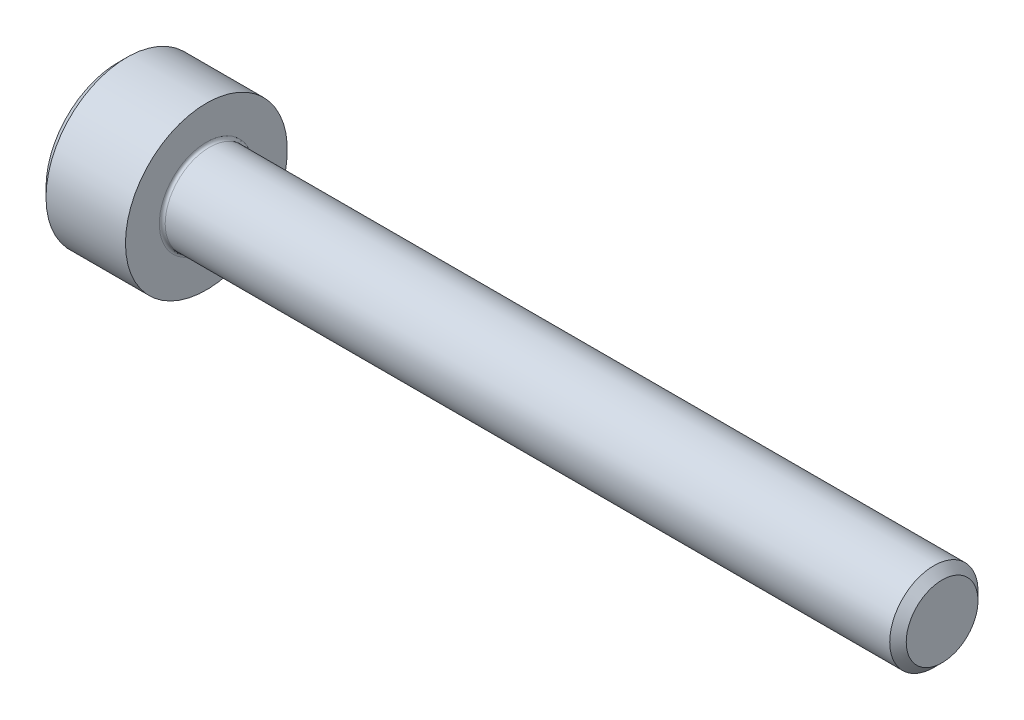
ISO-10303-21;
HEADER;
FILE_DESCRIPTION(('STEP AP214'),'2;1');
FILE_NAME('part.step','',(''),(''),'','','');
FILE_SCHEMA(('AUTOMOTIVE_DESIGN { 1 0 10303 214 1 1 1 1 }'));
ENDSEC;
DATA;
#1=APPLICATION_CONTEXT('core data for automotive mechanical design processes');
#2=APPLICATION_PROTOCOL_DEFINITION('international standard','automotive_design',2000,#1);
#3=PRODUCT_CONTEXT('',#1,'mechanical');
#4=PRODUCT('Part','Part','',(#3));
#5=PRODUCT_RELATED_PRODUCT_CATEGORY('part','',(#4));
#6=PRODUCT_DEFINITION_FORMATION('','',#4);
#7=PRODUCT_DEFINITION_CONTEXT('part definition',#1,'design');
#8=PRODUCT_DEFINITION('design','',#6,#7);
#9=PRODUCT_DEFINITION_SHAPE('','',#8);
#10=(LENGTH_UNIT() NAMED_UNIT(*) SI_UNIT(.MILLI.,.METRE.));
#11=(NAMED_UNIT(*) PLANE_ANGLE_UNIT() SI_UNIT($,.RADIAN.));
#12=(NAMED_UNIT(*) SI_UNIT($,.STERADIAN.) SOLID_ANGLE_UNIT());
#13=UNCERTAINTY_MEASURE_WITH_UNIT(LENGTH_MEASURE(1.E-05),#10,'distance_accuracy_value','');
#14=(GEOMETRIC_REPRESENTATION_CONTEXT(3) GLOBAL_UNCERTAINTY_ASSIGNED_CONTEXT((#13)) GLOBAL_UNIT_ASSIGNED_CONTEXT((#10,
#11,#12)) REPRESENTATION_CONTEXT('',''));
#15=CARTESIAN_POINT('',(0.,0.,0.));
#16=DIRECTION('',(0.,0.,1.));
#17=DIRECTION('',(1.,0.,0.));
#18=AXIS2_PLACEMENT_3D('',#15,#16,#17);
#19=CARTESIAN_POINT('',(0.,0.,0.));
#20=DIRECTION('',(-1.,0.,0.));
#21=DIRECTION('',(0.,0.,1.));
#22=AXIS2_PLACEMENT_3D('',#19,#20,#21);
#23=PLANE('',#22);
#24=DIRECTION('',(0.,-0.5,0.866025403784438));
#25=VECTOR('',#24,1.);
#26=CARTESIAN_POINT('',(0.,1.47801668912544,0.));
#27=LINE('',#26,#25);
#28=CARTESIAN_POINT('',(0.,1.47801668912544,0.));
#29=VERTEX_POINT('',#28);
#30=CARTESIAN_POINT('',(0.,0.739008344562717,1.28));
#31=VERTEX_POINT('',#30);
#32=EDGE_CURVE('E386',#29,#31,#27,.T.);
#33=ORIENTED_EDGE('',*,*,#32,.T.);
#34=DIRECTION('',(0.,1.,0.));
#35=VECTOR('',#34,1.);
#36=CARTESIAN_POINT('',(0.,-0.739008344562726,1.28));
#37=LINE('',#36,#35);
#38=CARTESIAN_POINT('',(0.,-0.739008344562726,1.28));
#39=VERTEX_POINT('',#38);
#40=EDGE_CURVE('E130',#39,#31,#37,.T.);
#41=ORIENTED_EDGE('',*,*,#40,.F.);
#42=DIRECTION('',(0.,-0.500000000000001,-0.866025403784438));
#43=VECTOR('',#42,1.);
#44=CARTESIAN_POINT('',(0.,-0.739008344562726,1.28));
#45=LINE('',#44,#43);
#46=CARTESIAN_POINT('',(0.,-1.47801668912545,0.));
#47=VERTEX_POINT('',#46);
#48=EDGE_CURVE('E389',#39,#47,#45,.T.);
#49=ORIENTED_EDGE('',*,*,#48,.T.);
#50=DIRECTION('',(0.,0.5,-0.866025403784439));
#51=VECTOR('',#50,1.);
#52=CARTESIAN_POINT('',(0.,-1.47801668912545,0.));
#53=LINE('',#52,#51);
#54=CARTESIAN_POINT('',(0.,-0.739008344562727,-1.28));
#55=VERTEX_POINT('',#54);
#56=EDGE_CURVE('E392',#47,#55,#53,.T.);
#57=ORIENTED_EDGE('',*,*,#56,.T.);
#58=DIRECTION('',(0.,-1.,0.));
#59=VECTOR('',#58,1.);
#60=CARTESIAN_POINT('',(0.,0.739008344562715,-1.28));
#61=LINE('',#60,#59);
#62=CARTESIAN_POINT('',(0.,0.739008344562715,-1.28));
#63=VERTEX_POINT('',#62);
#64=EDGE_CURVE('E395',#63,#55,#61,.T.);
#65=ORIENTED_EDGE('',*,*,#64,.F.);
#66=DIRECTION('',(0.,-0.500000000000001,-0.866025403784438));
#67=VECTOR('',#66,1.);
#68=CARTESIAN_POINT('',(0.,1.47801668912544,0.));
#69=LINE('',#68,#67);
#70=EDGE_CURVE('E125',#29,#63,#69,.T.);
#71=ORIENTED_EDGE('',*,*,#70,.F.);
#72=EDGE_LOOP('',(#33,#41,#49,#57,#65,#71));
#73=FACE_BOUND('',#72,.T.);
#74=CARTESIAN_POINT('',(0.,0.,0.));
#75=DIRECTION('',(-1.,0.,0.));
#76=DIRECTION('',(0.,0.,1.));
#77=AXIS2_PLACEMENT_3D('',#74,#75,#76);
#78=CIRCLE('',#77,2.45);
#79=CARTESIAN_POINT('',(0.,0.,2.45));
#80=VERTEX_POINT('',#79);
#81=EDGE_CURVE('E141',#80,#80,#78,.T.);
#82=ORIENTED_EDGE('',*,*,#81,.T.);
#83=EDGE_LOOP('',(#82));
#84=FACE_BOUND('',#83,.T.);
#85=ADVANCED_FACE('F34',(#73,#84),#23,.T.);
#86=CARTESIAN_POINT('',(28.,1.2195,0.));
#87=DIRECTION('',(1.,0.,0.));
#88=DIRECTION('',(0.,0.,-1.));
#89=AXIS2_PLACEMENT_3D('',#86,#87,#88);
#90=PLANE('',#89);
#91=CARTESIAN_POINT('',(28.,0.,0.));
#92=DIRECTION('',(-1.,0.,0.));
#93=DIRECTION('',(0.,0.,1.));
#94=AXIS2_PLACEMENT_3D('',#91,#92,#93);
#95=CIRCLE('',#94,1.2195);
#96=CARTESIAN_POINT('',(28.,0.,1.2195));
#97=VERTEX_POINT('',#96);
#98=EDGE_CURVE('E154',#97,#97,#95,.T.);
#99=ORIENTED_EDGE('',*,*,#98,.F.);
#100=EDGE_LOOP('',(#99));
#101=FACE_BOUND('',#100,.T.);
#102=ADVANCED_FACE('F175',(#101),#90,.T.);
#103=CARTESIAN_POINT('',(28.,0.,0.));
#104=DIRECTION('',(-1.,0.,0.));
#105=DIRECTION('',(0.,0.,1.));
#106=AXIS2_PLACEMENT_3D('',#103,#104,#105);
#107=CONICAL_SURFACE('',#106,1.2195,0.785398163397403);
#108=CARTESIAN_POINT('',(27.7195,0.,0.));
#109=DIRECTION('',(-1.,0.,0.));
#110=DIRECTION('',(0.,0.,1.));
#111=AXIS2_PLACEMENT_3D('',#108,#109,#110);
#112=CIRCLE('',#111,1.49999999999998);
#113=CARTESIAN_POINT('',(27.7195,0.,1.49999999999998));
#114=VERTEX_POINT('',#113);
#115=EDGE_CURVE('E151',#114,#114,#112,.T.);
#116=ORIENTED_EDGE('',*,*,#115,.F.);
#117=EDGE_LOOP('',(#116));
#118=FACE_BOUND('',#117,.T.);
#119=ORIENTED_EDGE('',*,*,#98,.T.);
#120=EDGE_LOOP('',(#119));
#121=FACE_BOUND('',#120,.T.);
#122=ADVANCED_FACE('F181',(#118,#121),#107,.T.);
#123=CARTESIAN_POINT('',(-31.75,0.,0.));
#124=DIRECTION('',(-1.,0.,0.));
#125=DIRECTION('',(0.,0.,1.));
#126=AXIS2_PLACEMENT_3D('',#123,#124,#125);
#127=CYLINDRICAL_SURFACE('',#126,1.49999999999999);
#128=CARTESIAN_POINT('',(3.1,0.,0.));
#129=DIRECTION('',(1.,0.,0.));
#130=DIRECTION('',(0.,0.,-1.));
#131=AXIS2_PLACEMENT_3D('',#128,#129,#130);
#132=CIRCLE('',#131,1.49999999999999);
#133=CARTESIAN_POINT('',(3.1,0.,-1.49999999999999));
#134=VERTEX_POINT('',#133);
#135=EDGE_CURVE('E11',#134,#134,#132,.T.);
#136=ORIENTED_EDGE('',*,*,#135,.T.);
#137=EDGE_LOOP('',(#136));
#138=FACE_BOUND('',#137,.T.);
#139=ORIENTED_EDGE('',*,*,#115,.T.);
#140=EDGE_LOOP('',(#139));
#141=FACE_BOUND('',#140,.T.);
#142=ADVANCED_FACE('F192',(#138,#141),#127,.T.);
#143=CARTESIAN_POINT('',(3.,2.75,0.));
#144=DIRECTION('',(1.,0.,0.));
#145=DIRECTION('',(0.,0.,-1.));
#146=AXIS2_PLACEMENT_3D('',#143,#144,#145);
#147=PLANE('',#146);
#148=CARTESIAN_POINT('',(3.,0.,0.));
#149=DIRECTION('',(1.,0.,0.));
#150=DIRECTION('',(0.,0.,-1.));
#151=AXIS2_PLACEMENT_3D('',#148,#149,#150);
#152=CIRCLE('',#151,1.59999999999999);
#153=CARTESIAN_POINT('',(3.,0.,-1.59999999999999));
#154=VERTEX_POINT('',#153);
#155=EDGE_CURVE('E42',#154,#154,#152,.F.);
#156=ORIENTED_EDGE('',*,*,#155,.T.);
#157=EDGE_LOOP('',(#156));
#158=FACE_BOUND('',#157,.T.);
#159=CARTESIAN_POINT('',(3.,0.,0.));
#160=DIRECTION('',(-1.,0.,0.));
#161=DIRECTION('',(0.,0.,1.));
#162=AXIS2_PLACEMENT_3D('',#159,#160,#161);
#163=CIRCLE('',#162,2.75);
#164=CARTESIAN_POINT('',(3.,0.,2.75));
#165=VERTEX_POINT('',#164);
#166=EDGE_CURVE('E148',#165,#165,#163,.T.);
#167=ORIENTED_EDGE('',*,*,#166,.F.);
#168=EDGE_LOOP('',(#167));
#169=FACE_BOUND('',#168,.T.);
#170=ADVANCED_FACE('F159',(#158,#169),#147,.T.);
#171=CARTESIAN_POINT('',(-31.75,0.,0.));
#172=DIRECTION('',(-1.,0.,0.));
#173=DIRECTION('',(0.,0.,1.));
#174=AXIS2_PLACEMENT_3D('',#171,#172,#173);
#175=CYLINDRICAL_SURFACE('',#174,2.75);
#176=ORIENTED_EDGE('',*,*,#166,.T.);
#177=EDGE_LOOP('',(#176));
#178=FACE_BOUND('',#177,.T.);
#179=CARTESIAN_POINT('',(0.300000000000002,0.,0.));
#180=DIRECTION('',(-1.,0.,0.));
#181=DIRECTION('',(0.,0.,1.));
#182=AXIS2_PLACEMENT_3D('',#179,#180,#181);
#183=CIRCLE('',#182,2.75);
#184=CARTESIAN_POINT('',(0.300000000000002,0.,2.75));
#185=VERTEX_POINT('',#184);
#186=EDGE_CURVE('E145',#185,#185,#183,.T.);
#187=ORIENTED_EDGE('',*,*,#186,.F.);
#188=EDGE_LOOP('',(#187));
#189=FACE_BOUND('',#188,.T.);
#190=ADVANCED_FACE('F170',(#178,#189),#175,.T.);
#191=CARTESIAN_POINT('',(0.,0.,0.));
#192=DIRECTION('',(1.,0.,0.));
#193=DIRECTION('',(0.,0.,-1.));
#194=AXIS2_PLACEMENT_3D('',#191,#192,#193);
#195=CONICAL_SURFACE('',#194,2.45,0.785398163397441);
#196=ORIENTED_EDGE('',*,*,#186,.T.);
#197=EDGE_LOOP('',(#196));
#198=FACE_BOUND('',#197,.T.);
#199=ORIENTED_EDGE('',*,*,#81,.F.);
#200=EDGE_LOOP('',(#199));
#201=FACE_BOUND('',#200,.T.);
#202=ADVANCED_FACE('F163',(#198,#201),#195,.T.);
#203=CARTESIAN_POINT('',(3.1,0.,0.));
#204=DIRECTION('',(1.,0.,0.));
#205=DIRECTION('',(0.,0.,-1.));
#206=AXIS2_PLACEMENT_3D('',#203,#204,#205);
#207=TOROIDAL_SURFACE('',#206,1.59999999999999,0.1);
#208=ORIENTED_EDGE('',*,*,#135,.F.);
#209=EDGE_LOOP('',(#208));
#210=FACE_BOUND('',#209,.T.);
#211=ORIENTED_EDGE('',*,*,#155,.F.);
#212=EDGE_LOOP('',(#211));
#213=FACE_BOUND('',#212,.T.);
#214=ADVANCED_FACE('F36',(#210,#213),#207,.F.);
#215=CARTESIAN_POINT('',(1.3,1.47801668912544,0.));
#216=DIRECTION('',(0.,-0.866025403784438,-0.5));
#217=DIRECTION('',(0.,0.5,-0.866025403784439));
#218=AXIS2_PLACEMENT_3D('',#215,#216,#217);
#219=PLANE('',#218);
#220=ORIENTED_EDGE('',*,*,#32,.F.);
#221=DIRECTION('',(-1.,0.,0.));
#222=VECTOR('',#221,1.);
#223=CARTESIAN_POINT('',(1.3,1.47801668912544,0.));
#224=LINE('',#223,#222);
#225=CARTESIAN_POINT('',(1.3,1.47801668912544,0.));
#226=VERTEX_POINT('',#225);
#227=EDGE_CURVE('E376',#226,#29,#224,.T.);
#228=ORIENTED_EDGE('',*,*,#227,.F.);
#229=DIRECTION('',(0.,-0.5,0.866025403784438));
#230=VECTOR('',#229,1.);
#231=CARTESIAN_POINT('',(1.3,1.47801668912544,0.));
#232=LINE('',#231,#230);
#233=CARTESIAN_POINT('',(1.3,1.10851251684408,0.639999999999999));
#234=VERTEX_POINT('',#233);
#235=EDGE_CURVE('E117',#226,#234,#232,.T.);
#236=ORIENTED_EDGE('',*,*,#235,.T.);
#237=CARTESIAN_POINT('',(1.3,0.739008344562717,1.28));
#238=VERTEX_POINT('',#237);
#239=EDGE_CURVE('E108',#234,#238,#232,.T.);
#240=ORIENTED_EDGE('',*,*,#239,.T.);
#241=DIRECTION('',(-1.,0.,0.));
#242=VECTOR('',#241,1.);
#243=CARTESIAN_POINT('',(1.3,0.739008344562717,1.28));
#244=LINE('',#243,#242);
#245=EDGE_CURVE('E122',#238,#31,#244,.T.);
#246=ORIENTED_EDGE('',*,*,#245,.T.);
#247=EDGE_LOOP('',(#220,#228,#236,#240,#246));
#248=FACE_BOUND('',#247,.T.);
#249=ADVANCED_FACE('F121',(#248),#219,.T.);
#250=CARTESIAN_POINT('',(1.3,-0.739008344562726,1.28));
#251=DIRECTION('',(0.,0.,1.));
#252=DIRECTION('',(0.,-1.,0.));
#253=AXIS2_PLACEMENT_3D('',#250,#251,#252);
#254=PLANE('',#253);
#255=ORIENTED_EDGE('',*,*,#40,.T.);
#256=ORIENTED_EDGE('',*,*,#245,.F.);
#257=DIRECTION('',(0.,1.,0.));
#258=VECTOR('',#257,1.);
#259=CARTESIAN_POINT('',(1.3,-0.739008344562726,1.28));
#260=LINE('',#259,#258);
#261=CARTESIAN_POINT('',(1.3,0.,1.28));
#262=VERTEX_POINT('',#261);
#263=EDGE_CURVE('E105',#262,#238,#260,.T.);
#264=ORIENTED_EDGE('',*,*,#263,.F.);
#265=CARTESIAN_POINT('',(1.3,-0.739008344562726,1.28));
#266=VERTEX_POINT('',#265);
#267=EDGE_CURVE('E116',#266,#262,#260,.T.);
#268=ORIENTED_EDGE('',*,*,#267,.F.);
#269=DIRECTION('',(-1.,0.,0.));
#270=VECTOR('',#269,1.);
#271=CARTESIAN_POINT('',(1.3,-0.739008344562726,1.28));
#272=LINE('',#271,#270);
#273=EDGE_CURVE('E132',#266,#39,#272,.T.);
#274=ORIENTED_EDGE('',*,*,#273,.T.);
#275=EDGE_LOOP('',(#255,#256,#264,#268,#274));
#276=FACE_BOUND('',#275,.T.);
#277=ADVANCED_FACE('F127',(#276),#254,.F.);
#278=CARTESIAN_POINT('',(1.3,-0.739008344562726,1.28));
#279=DIRECTION('',(0.,0.866025403784438,-0.500000000000001));
#280=DIRECTION('',(0.,0.500000000000001,0.866025403784438));
#281=AXIS2_PLACEMENT_3D('',#278,#279,#280);
#282=PLANE('',#281);
#283=ORIENTED_EDGE('',*,*,#48,.F.);
#284=ORIENTED_EDGE('',*,*,#273,.F.);
#285=DIRECTION('',(0.,-0.500000000000001,-0.866025403784438));
#286=VECTOR('',#285,1.);
#287=CARTESIAN_POINT('',(1.3,-0.739008344562726,1.28));
#288=LINE('',#287,#286);
#289=CARTESIAN_POINT('',(1.3,-1.10851251684409,0.640000000000004));
#290=VERTEX_POINT('',#289);
#291=EDGE_CURVE('E415',#266,#290,#288,.T.);
#292=ORIENTED_EDGE('',*,*,#291,.T.);
#293=CARTESIAN_POINT('',(1.3,-1.47801668912545,0.));
#294=VERTEX_POINT('',#293);
#295=EDGE_CURVE('E404',#290,#294,#288,.T.);
#296=ORIENTED_EDGE('',*,*,#295,.T.);
#297=DIRECTION('',(-1.,0.,0.));
#298=VECTOR('',#297,1.);
#299=CARTESIAN_POINT('',(1.3,-1.47801668912545,0.));
#300=LINE('',#299,#298);
#301=EDGE_CURVE('E137',#294,#47,#300,.T.);
#302=ORIENTED_EDGE('',*,*,#301,.T.);
#303=EDGE_LOOP('',(#283,#284,#292,#296,#302));
#304=FACE_BOUND('',#303,.T.);
#305=ADVANCED_FACE('F267',(#304),#282,.T.);
#306=CARTESIAN_POINT('',(1.3,-1.47801668912545,0.));
#307=DIRECTION('',(0.,0.866025403784439,0.5));
#308=DIRECTION('',(0.,-0.5,0.866025403784439));
#309=AXIS2_PLACEMENT_3D('',#306,#307,#308);
#310=PLANE('',#309);
#311=ORIENTED_EDGE('',*,*,#56,.F.);
#312=ORIENTED_EDGE('',*,*,#301,.F.);
#313=DIRECTION('',(0.,0.5,-0.866025403784439));
#314=VECTOR('',#313,1.);
#315=CARTESIAN_POINT('',(1.3,-1.47801668912545,0.));
#316=LINE('',#315,#314);
#317=CARTESIAN_POINT('',(1.3,-1.10851251684409,-0.640000000000002));
#318=VERTEX_POINT('',#317);
#319=EDGE_CURVE('E382',#294,#318,#316,.T.);
#320=ORIENTED_EDGE('',*,*,#319,.T.);
#321=CARTESIAN_POINT('',(1.3,-0.739008344562727,-1.28));
#322=VERTEX_POINT('',#321);
#323=EDGE_CURVE('E414',#318,#322,#316,.T.);
#324=ORIENTED_EDGE('',*,*,#323,.T.);
#325=DIRECTION('',(-1.,0.,0.));
#326=VECTOR('',#325,1.);
#327=CARTESIAN_POINT('',(1.3,-0.739008344562727,-1.28));
#328=LINE('',#327,#326);
#329=EDGE_CURVE('E375',#322,#55,#328,.T.);
#330=ORIENTED_EDGE('',*,*,#329,.T.);
#331=EDGE_LOOP('',(#311,#312,#320,#324,#330));
#332=FACE_BOUND('',#331,.T.);
#333=ADVANCED_FACE('F275',(#332),#310,.T.);
#334=CARTESIAN_POINT('',(1.3,0.739008344562715,-1.28));
#335=DIRECTION('',(0.,0.,-1.));
#336=DIRECTION('',(0.,1.,0.));
#337=AXIS2_PLACEMENT_3D('',#334,#335,#336);
#338=PLANE('',#337);
#339=ORIENTED_EDGE('',*,*,#64,.T.);
#340=ORIENTED_EDGE('',*,*,#329,.F.);
#341=DIRECTION('',(0.,-1.,0.));
#342=VECTOR('',#341,1.);
#343=CARTESIAN_POINT('',(1.3,0.739008344562715,-1.28));
#344=LINE('',#343,#342);
#345=CARTESIAN_POINT('',(1.3,0.,-1.28));
#346=VERTEX_POINT('',#345);
#347=EDGE_CURVE('E379',#346,#322,#344,.T.);
#348=ORIENTED_EDGE('',*,*,#347,.F.);
#349=CARTESIAN_POINT('',(1.3,0.739008344562715,-1.28));
#350=VERTEX_POINT('',#349);
#351=EDGE_CURVE('E49',#350,#346,#344,.T.);
#352=ORIENTED_EDGE('',*,*,#351,.F.);
#353=DIRECTION('',(-1.,0.,0.));
#354=VECTOR('',#353,1.);
#355=CARTESIAN_POINT('',(1.3,0.739008344562715,-1.28));
#356=LINE('',#355,#354);
#357=EDGE_CURVE('E372',#350,#63,#356,.T.);
#358=ORIENTED_EDGE('',*,*,#357,.T.);
#359=EDGE_LOOP('',(#339,#340,#348,#352,#358));
#360=FACE_BOUND('',#359,.T.);
#361=ADVANCED_FACE('F284',(#360),#338,.F.);
#362=CARTESIAN_POINT('',(1.3,1.47801668912544,0.));
#363=DIRECTION('',(0.,0.866025403784438,-0.500000000000001));
#364=DIRECTION('',(0.,0.500000000000001,0.866025403784438));
#365=AXIS2_PLACEMENT_3D('',#362,#363,#364);
#366=PLANE('',#365);
#367=ORIENTED_EDGE('',*,*,#70,.T.);
#368=ORIENTED_EDGE('',*,*,#357,.F.);
#369=DIRECTION('',(0.,-0.500000000000001,-0.866025403784438));
#370=VECTOR('',#369,1.);
#371=CARTESIAN_POINT('',(1.3,1.47801668912544,0.));
#372=LINE('',#371,#370);
#373=CARTESIAN_POINT('',(1.3,1.10851251684408,-0.64));
#374=VERTEX_POINT('',#373);
#375=EDGE_CURVE('E362',#374,#350,#372,.T.);
#376=ORIENTED_EDGE('',*,*,#375,.F.);
#377=EDGE_CURVE('E368',#226,#374,#372,.T.);
#378=ORIENTED_EDGE('',*,*,#377,.F.);
#379=ORIENTED_EDGE('',*,*,#227,.T.);
#380=EDGE_LOOP('',(#367,#368,#376,#378,#379));
#381=FACE_BOUND('',#380,.T.);
#382=ADVANCED_FACE('F293',(#381),#366,.F.);
#383=CARTESIAN_POINT('',(1.3,1.47801668912544,0.));
#384=DIRECTION('',(1.,0.,0.));
#385=DIRECTION('',(0.,0.,-1.));
#386=AXIS2_PLACEMENT_3D('',#383,#384,#385);
#387=PLANE('',#386);
#388=ORIENTED_EDGE('',*,*,#347,.T.);
#389=ORIENTED_EDGE('',*,*,#323,.F.);
#390=CARTESIAN_POINT('',(1.3,0.,0.));
#391=DIRECTION('',(-1.,0.,0.));
#392=DIRECTION('',(0.,0.,1.));
#393=AXIS2_PLACEMENT_3D('',#390,#391,#392);
#394=CIRCLE('',#393,1.28);
#395=EDGE_CURVE('E410',#346,#318,#394,.T.);
#396=ORIENTED_EDGE('',*,*,#395,.F.);
#397=EDGE_LOOP('',(#388,#389,#396));
#398=FACE_BOUND('',#397,.T.);
#399=ADVANCED_FACE('F302',(#398),#387,.F.);
#400=ORIENTED_EDGE('',*,*,#319,.F.);
#401=ORIENTED_EDGE('',*,*,#295,.F.);
#402=EDGE_CURVE('E135',#318,#290,#394,.T.);
#403=ORIENTED_EDGE('',*,*,#402,.F.);
#404=EDGE_LOOP('',(#400,#401,#403));
#405=FACE_BOUND('',#404,.T.);
#406=ADVANCED_FACE('F311',(#405),#387,.F.);
#407=ORIENTED_EDGE('',*,*,#291,.F.);
#408=ORIENTED_EDGE('',*,*,#267,.T.);
#409=EDGE_CURVE('E131',#290,#262,#394,.T.);
#410=ORIENTED_EDGE('',*,*,#409,.F.);
#411=EDGE_LOOP('',(#407,#408,#410));
#412=FACE_BOUND('',#411,.T.);
#413=ADVANCED_FACE('F320',(#412),#387,.F.);
#414=ORIENTED_EDGE('',*,*,#263,.T.);
#415=ORIENTED_EDGE('',*,*,#239,.F.);
#416=EDGE_CURVE('E111',#262,#234,#394,.T.);
#417=ORIENTED_EDGE('',*,*,#416,.F.);
#418=EDGE_LOOP('',(#414,#415,#417));
#419=FACE_BOUND('',#418,.T.);
#420=ADVANCED_FACE('F107',(#419),#387,.F.);
#421=ORIENTED_EDGE('',*,*,#235,.F.);
#422=ORIENTED_EDGE('',*,*,#377,.T.);
#423=EDGE_CURVE('E142',#234,#374,#394,.T.);
#424=ORIENTED_EDGE('',*,*,#423,.F.);
#425=EDGE_LOOP('',(#421,#422,#424));
#426=FACE_BOUND('',#425,.T.);
#427=ADVANCED_FACE('F335',(#426),#387,.F.);
#428=ORIENTED_EDGE('',*,*,#375,.T.);
#429=ORIENTED_EDGE('',*,*,#351,.T.);
#430=EDGE_CURVE('E365',#374,#346,#394,.T.);
#431=ORIENTED_EDGE('',*,*,#430,.F.);
#432=EDGE_LOOP('',(#428,#429,#431));
#433=FACE_BOUND('',#432,.T.);
#434=ADVANCED_FACE('F250',(#433),#387,.F.);
#435=CARTESIAN_POINT('',(1.3,0.,0.));
#436=DIRECTION('',(-1.,0.,0.));
#437=DIRECTION('',(0.,0.,1.));
#438=AXIS2_PLACEMENT_3D('',#435,#436,#437);
#439=CONICAL_SURFACE('',#438,1.28,1.0471975511966);
#440=CARTESIAN_POINT('',(2.03900834456273,0.,0.));
#441=VERTEX_POINT('',#440);
#442=VERTEX_LOOP('',#441);
#443=FACE_BOUND('',#442,.T.);
#444=ORIENTED_EDGE('',*,*,#416,.T.);
#445=ORIENTED_EDGE('',*,*,#423,.T.);
#446=ORIENTED_EDGE('',*,*,#430,.T.);
#447=ORIENTED_EDGE('',*,*,#395,.T.);
#448=ORIENTED_EDGE('',*,*,#402,.T.);
#449=ORIENTED_EDGE('',*,*,#409,.T.);
#450=EDGE_LOOP('',(#444,#445,#446,#447,#448,#449));
#451=FACE_BOUND('',#450,.T.);
#452=ADVANCED_FACE('F185',(#443,#451),#439,.F.);
#453=CLOSED_SHELL('',(#85,#102,#122,#142,#170,#190,#202,#214,#249,#277,#305,#333,#361,#382,#399,
#406,#413,#420,#427,#434,#452));
#454=MANIFOLD_SOLID_BREP('B2',#453);
#455=ADVANCED_BREP_SHAPE_REPRESENTATION('',(#18,#454),#14);
#456=SHAPE_DEFINITION_REPRESENTATION(#9,#455);
ENDSEC;
END-ISO-10303-21;
